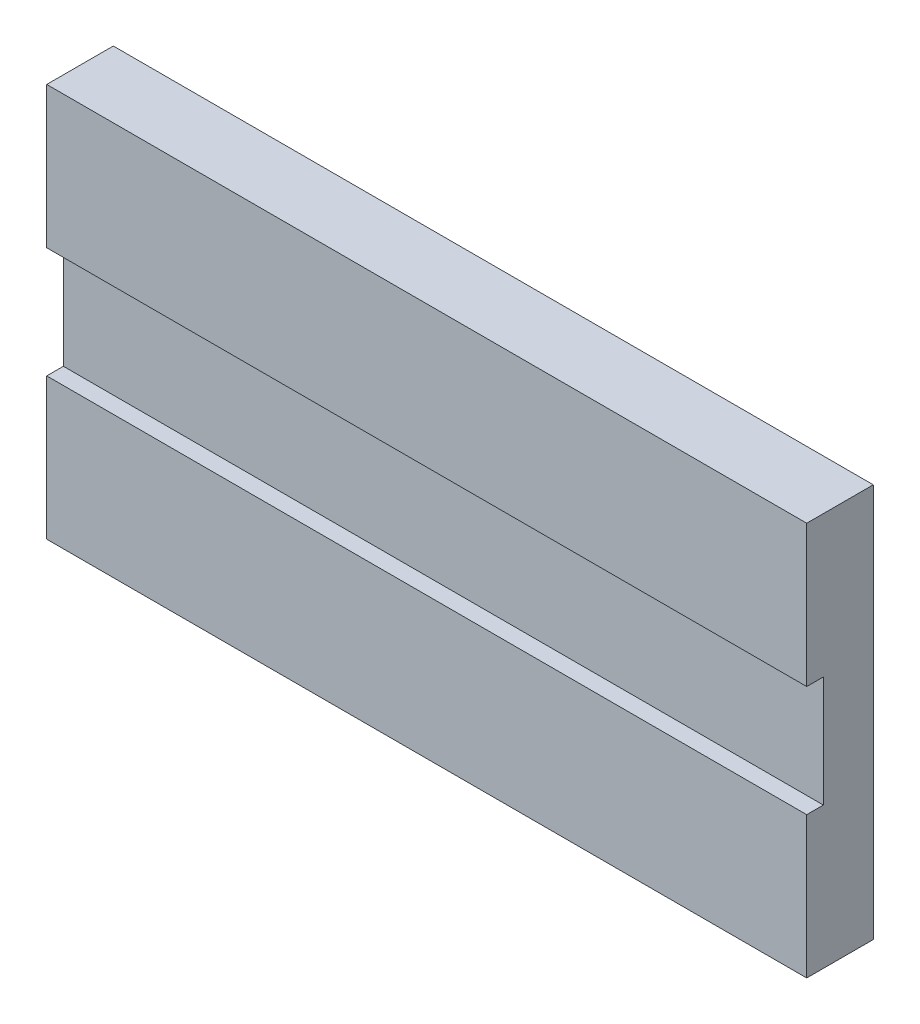
ISO-10303-21;
HEADER;
FILE_DESCRIPTION(('STEP AP214'),'2;1');
FILE_NAME('part.step','',(''),(''),'','','');
FILE_SCHEMA(('AUTOMOTIVE_DESIGN { 1 0 10303 214 1 1 1 1 }'));
ENDSEC;
DATA;
#1=APPLICATION_CONTEXT('core data for automotive mechanical design processes');
#2=APPLICATION_PROTOCOL_DEFINITION('international standard','automotive_design',2000,#1);
#3=PRODUCT_CONTEXT('',#1,'mechanical');
#4=PRODUCT('Part','Part','',(#3));
#5=PRODUCT_RELATED_PRODUCT_CATEGORY('part','',(#4));
#6=PRODUCT_DEFINITION_FORMATION('','',#4);
#7=PRODUCT_DEFINITION_CONTEXT('part definition',#1,'design');
#8=PRODUCT_DEFINITION('design','',#6,#7);
#9=PRODUCT_DEFINITION_SHAPE('','',#8);
#10=(LENGTH_UNIT() NAMED_UNIT(*) SI_UNIT(.MILLI.,.METRE.));
#11=(NAMED_UNIT(*) PLANE_ANGLE_UNIT() SI_UNIT($,.RADIAN.));
#12=(NAMED_UNIT(*) SI_UNIT($,.STERADIAN.) SOLID_ANGLE_UNIT());
#13=UNCERTAINTY_MEASURE_WITH_UNIT(LENGTH_MEASURE(1.E-05),#10,'distance_accuracy_value','');
#14=(GEOMETRIC_REPRESENTATION_CONTEXT(3) GLOBAL_UNCERTAINTY_ASSIGNED_CONTEXT((#13)) GLOBAL_UNIT_ASSIGNED_CONTEXT((#10,
#11,#12)) REPRESENTATION_CONTEXT('',''));
#15=CARTESIAN_POINT('',(0.,0.,0.));
#16=DIRECTION('',(0.,0.,1.));
#17=DIRECTION('',(1.,0.,0.));
#18=AXIS2_PLACEMENT_3D('',#15,#16,#17);
#19=CARTESIAN_POINT('',(0.,0.,12.));
#20=DIRECTION('',(0.,0.,-1.));
#21=DIRECTION('',(-1.,0.,0.));
#22=AXIS2_PLACEMENT_3D('',#19,#20,#21);
#23=PLANE('',#22);
#24=DIRECTION('',(0.,-1.,0.));
#25=VECTOR('',#24,1.);
#26=CARTESIAN_POINT('',(0.,-71.,12.));
#27=LINE('',#26,#25);
#28=CARTESIAN_POINT('',(0.,0.,12.));
#29=VERTEX_POINT('',#28);
#30=CARTESIAN_POINT('',(0.,-25.5,12.));
#31=VERTEX_POINT('',#30);
#32=EDGE_CURVE('E138',#29,#31,#27,.T.);
#33=ORIENTED_EDGE('',*,*,#32,.T.);
#34=DIRECTION('',(1.,0.,0.));
#35=VECTOR('',#34,1.);
#36=CARTESIAN_POINT('',(0.,-25.5,12.));
#37=LINE('',#36,#35);
#38=CARTESIAN_POINT('',(137.,-25.5,12.));
#39=VERTEX_POINT('',#38);
#40=EDGE_CURVE('E132',#31,#39,#37,.T.);
#41=ORIENTED_EDGE('',*,*,#40,.T.);
#42=DIRECTION('',(0.,1.,0.));
#43=VECTOR('',#42,1.);
#44=CARTESIAN_POINT('',(137.,0.,12.));
#45=LINE('',#44,#43);
#46=CARTESIAN_POINT('',(137.,0.,12.));
#47=VERTEX_POINT('',#46);
#48=EDGE_CURVE('E142',#39,#47,#45,.T.);
#49=ORIENTED_EDGE('',*,*,#48,.T.);
#50=DIRECTION('',(-1.,0.,0.));
#51=VECTOR('',#50,1.);
#52=CARTESIAN_POINT('',(0.,0.,12.));
#53=LINE('',#52,#51);
#54=EDGE_CURVE('E55',#47,#29,#53,.T.);
#55=ORIENTED_EDGE('',*,*,#54,.T.);
#56=EDGE_LOOP('',(#33,#41,#49,#55));
#57=FACE_BOUND('',#56,.T.);
#58=ADVANCED_FACE('F31',(#57),#23,.F.);
#59=CARTESIAN_POINT('',(0.,-71.,12.));
#60=DIRECTION('',(1.,0.,0.));
#61=DIRECTION('',(0.,0.,-1.));
#62=AXIS2_PLACEMENT_3D('',#59,#60,#61);
#63=PLANE('',#62);
#64=DIRECTION('',(0.,1.,0.));
#65=VECTOR('',#64,1.);
#66=CARTESIAN_POINT('',(0.,-45.5,9.));
#67=LINE('',#66,#65);
#68=CARTESIAN_POINT('',(0.,-45.5,9.));
#69=VERTEX_POINT('',#68);
#70=CARTESIAN_POINT('',(0.,-25.5,9.));
#71=VERTEX_POINT('',#70);
#72=EDGE_CURVE('E116',#69,#71,#67,.T.);
#73=ORIENTED_EDGE('',*,*,#72,.T.);
#74=DIRECTION('',(0.,0.,1.));
#75=VECTOR('',#74,1.);
#76=CARTESIAN_POINT('',(0.,-25.5,9.));
#77=LINE('',#76,#75);
#78=EDGE_CURVE('E121',#71,#31,#77,.T.);
#79=ORIENTED_EDGE('',*,*,#78,.T.);
#80=ORIENTED_EDGE('',*,*,#32,.F.);
#81=DIRECTION('',(0.,0.,-1.));
#82=VECTOR('',#81,1.);
#83=CARTESIAN_POINT('',(0.,0.,12.));
#84=LINE('',#83,#82);
#85=CARTESIAN_POINT('',(0.,0.,0.));
#86=VERTEX_POINT('',#85);
#87=EDGE_CURVE('E147',#29,#86,#84,.T.);
#88=ORIENTED_EDGE('',*,*,#87,.T.);
#89=DIRECTION('',(0.,-1.,0.));
#90=VECTOR('',#89,1.);
#91=CARTESIAN_POINT('',(0.,-71.,0.));
#92=LINE('',#91,#90);
#93=CARTESIAN_POINT('',(0.,-71.,0.));
#94=VERTEX_POINT('',#93);
#95=EDGE_CURVE('E135',#86,#94,#92,.T.);
#96=ORIENTED_EDGE('',*,*,#95,.T.);
#97=DIRECTION('',(0.,0.,-1.));
#98=VECTOR('',#97,1.);
#99=CARTESIAN_POINT('',(0.,-71.,12.));
#100=LINE('',#99,#98);
#101=CARTESIAN_POINT('',(0.,-71.,12.));
#102=VERTEX_POINT('',#101);
#103=EDGE_CURVE('E11',#102,#94,#100,.T.);
#104=ORIENTED_EDGE('',*,*,#103,.F.);
#105=CARTESIAN_POINT('',(0.,-45.5,12.));
#106=VERTEX_POINT('',#105);
#107=EDGE_CURVE('E83',#106,#102,#27,.T.);
#108=ORIENTED_EDGE('',*,*,#107,.F.);
#109=DIRECTION('',(0.,0.,-1.));
#110=VECTOR('',#109,1.);
#111=CARTESIAN_POINT('',(0.,-45.5,12.));
#112=LINE('',#111,#110);
#113=EDGE_CURVE('E46',#106,#69,#112,.T.);
#114=ORIENTED_EDGE('',*,*,#113,.T.);
#115=EDGE_LOOP('',(#73,#79,#80,#88,#96,#104,#108,#114));
#116=FACE_BOUND('',#115,.T.);
#117=ADVANCED_FACE('F33',(#116),#63,.F.);
#118=CARTESIAN_POINT('',(137.,-71.,12.));
#119=DIRECTION('',(0.,1.,0.));
#120=DIRECTION('',(-1.,0.,0.));
#121=AXIS2_PLACEMENT_3D('',#118,#119,#120);
#122=PLANE('',#121);
#123=DIRECTION('',(1.,0.,0.));
#124=VECTOR('',#123,1.);
#125=CARTESIAN_POINT('',(137.,-71.,0.));
#126=LINE('',#125,#124);
#127=CARTESIAN_POINT('',(137.,-71.,0.));
#128=VERTEX_POINT('',#127);
#129=EDGE_CURVE('E150',#94,#128,#126,.T.);
#130=ORIENTED_EDGE('',*,*,#129,.T.);
#131=DIRECTION('',(0.,0.,-1.));
#132=VECTOR('',#131,1.);
#133=CARTESIAN_POINT('',(137.,-71.,12.));
#134=LINE('',#133,#132);
#135=CARTESIAN_POINT('',(137.,-71.,12.));
#136=VERTEX_POINT('',#135);
#137=EDGE_CURVE('E39',#136,#128,#134,.T.);
#138=ORIENTED_EDGE('',*,*,#137,.F.);
#139=DIRECTION('',(1.,0.,0.));
#140=VECTOR('',#139,1.);
#141=CARTESIAN_POINT('',(137.,-71.,12.));
#142=LINE('',#141,#140);
#143=EDGE_CURVE('E140',#102,#136,#142,.T.);
#144=ORIENTED_EDGE('',*,*,#143,.F.);
#145=ORIENTED_EDGE('',*,*,#103,.T.);
#146=EDGE_LOOP('',(#130,#138,#144,#145));
#147=FACE_BOUND('',#146,.T.);
#148=ADVANCED_FACE('F175',(#147),#122,.F.);
#149=CARTESIAN_POINT('',(137.,0.,12.));
#150=DIRECTION('',(-1.,0.,0.));
#151=DIRECTION('',(0.,0.,1.));
#152=AXIS2_PLACEMENT_3D('',#149,#150,#151);
#153=PLANE('',#152);
#154=ORIENTED_EDGE('',*,*,#48,.F.);
#155=DIRECTION('',(0.,0.,1.));
#156=VECTOR('',#155,1.);
#157=CARTESIAN_POINT('',(137.,-25.5,9.));
#158=LINE('',#157,#156);
#159=CARTESIAN_POINT('',(137.,-25.5,9.));
#160=VERTEX_POINT('',#159);
#161=EDGE_CURVE('E124',#160,#39,#158,.T.);
#162=ORIENTED_EDGE('',*,*,#161,.F.);
#163=DIRECTION('',(0.,1.,0.));
#164=VECTOR('',#163,1.);
#165=CARTESIAN_POINT('',(137.,-45.5,9.));
#166=LINE('',#165,#164);
#167=CARTESIAN_POINT('',(137.,-45.5,9.));
#168=VERTEX_POINT('',#167);
#169=EDGE_CURVE('E126',#168,#160,#166,.T.);
#170=ORIENTED_EDGE('',*,*,#169,.F.);
#171=DIRECTION('',(0.,0.,-1.));
#172=VECTOR('',#171,1.);
#173=CARTESIAN_POINT('',(137.,-45.5,12.));
#174=LINE('',#173,#172);
#175=CARTESIAN_POINT('',(137.,-45.5,12.));
#176=VERTEX_POINT('',#175);
#177=EDGE_CURVE('E108',#176,#168,#174,.T.);
#178=ORIENTED_EDGE('',*,*,#177,.F.);
#179=EDGE_CURVE('E143',#136,#176,#45,.T.);
#180=ORIENTED_EDGE('',*,*,#179,.F.);
#181=ORIENTED_EDGE('',*,*,#137,.T.);
#182=DIRECTION('',(0.,1.,0.));
#183=VECTOR('',#182,1.);
#184=CARTESIAN_POINT('',(137.,0.,0.));
#185=LINE('',#184,#183);
#186=CARTESIAN_POINT('',(137.,0.,0.));
#187=VERTEX_POINT('',#186);
#188=EDGE_CURVE('E152',#128,#187,#185,.T.);
#189=ORIENTED_EDGE('',*,*,#188,.T.);
#190=DIRECTION('',(0.,0.,-1.));
#191=VECTOR('',#190,1.);
#192=CARTESIAN_POINT('',(137.,0.,12.));
#193=LINE('',#192,#191);
#194=EDGE_CURVE('E156',#47,#187,#193,.T.);
#195=ORIENTED_EDGE('',*,*,#194,.F.);
#196=EDGE_LOOP('',(#154,#162,#170,#178,#180,#181,#189,#195));
#197=FACE_BOUND('',#196,.T.);
#198=ADVANCED_FACE('F163',(#197),#153,.F.);
#199=CARTESIAN_POINT('',(0.,0.,12.));
#200=DIRECTION('',(0.,-1.,0.));
#201=DIRECTION('',(0.,0.,-1.));
#202=AXIS2_PLACEMENT_3D('',#199,#200,#201);
#203=PLANE('',#202);
#204=DIRECTION('',(-1.,0.,0.));
#205=VECTOR('',#204,1.);
#206=CARTESIAN_POINT('',(0.,0.,0.));
#207=LINE('',#206,#205);
#208=EDGE_CURVE('E76',#187,#86,#207,.T.);
#209=ORIENTED_EDGE('',*,*,#208,.T.);
#210=ORIENTED_EDGE('',*,*,#87,.F.);
#211=ORIENTED_EDGE('',*,*,#54,.F.);
#212=ORIENTED_EDGE('',*,*,#194,.T.);
#213=EDGE_LOOP('',(#209,#210,#211,#212));
#214=FACE_BOUND('',#213,.T.);
#215=ADVANCED_FACE('F170',(#214),#203,.F.);
#216=ORIENTED_EDGE('',*,*,#179,.T.);
#217=DIRECTION('',(1.,0.,0.));
#218=VECTOR('',#217,1.);
#219=CARTESIAN_POINT('',(0.,-45.5,12.));
#220=LINE('',#219,#218);
#221=EDGE_CURVE('E113',#106,#176,#220,.T.);
#222=ORIENTED_EDGE('',*,*,#221,.F.);
#223=ORIENTED_EDGE('',*,*,#107,.T.);
#224=ORIENTED_EDGE('',*,*,#143,.T.);
#225=EDGE_LOOP('',(#216,#222,#223,#224));
#226=FACE_BOUND('',#225,.T.);
#227=ADVANCED_FACE('F174',(#226),#23,.F.);
#228=CARTESIAN_POINT('',(0.,0.,0.));
#229=DIRECTION('',(0.,0.,-1.));
#230=DIRECTION('',(-1.,0.,0.));
#231=AXIS2_PLACEMENT_3D('',#228,#229,#230);
#232=PLANE('',#231);
#233=ORIENTED_EDGE('',*,*,#95,.F.);
#234=ORIENTED_EDGE('',*,*,#208,.F.);
#235=ORIENTED_EDGE('',*,*,#188,.F.);
#236=ORIENTED_EDGE('',*,*,#129,.F.);
#237=EDGE_LOOP('',(#233,#234,#235,#236));
#238=FACE_BOUND('',#237,.T.);
#239=ADVANCED_FACE('F168',(#238),#232,.T.);
#240=CARTESIAN_POINT('',(0.,-25.5,9.));
#241=DIRECTION('',(0.,1.,0.));
#242=DIRECTION('',(0.,0.,1.));
#243=AXIS2_PLACEMENT_3D('',#240,#241,#242);
#244=PLANE('',#243);
#245=ORIENTED_EDGE('',*,*,#161,.T.);
#246=ORIENTED_EDGE('',*,*,#40,.F.);
#247=ORIENTED_EDGE('',*,*,#78,.F.);
#248=DIRECTION('',(1.,0.,0.));
#249=VECTOR('',#248,1.);
#250=CARTESIAN_POINT('',(0.,-25.5,9.));
#251=LINE('',#250,#249);
#252=EDGE_CURVE('E112',#71,#160,#251,.T.);
#253=ORIENTED_EDGE('',*,*,#252,.T.);
#254=EDGE_LOOP('',(#245,#246,#247,#253));
#255=FACE_BOUND('',#254,.T.);
#256=ADVANCED_FACE('F173',(#255),#244,.F.);
#257=CARTESIAN_POINT('',(0.,-45.5,9.));
#258=DIRECTION('',(0.,0.,-1.));
#259=DIRECTION('',(-1.,0.,0.));
#260=AXIS2_PLACEMENT_3D('',#257,#258,#259);
#261=PLANE('',#260);
#262=ORIENTED_EDGE('',*,*,#169,.T.);
#263=ORIENTED_EDGE('',*,*,#252,.F.);
#264=ORIENTED_EDGE('',*,*,#72,.F.);
#265=DIRECTION('',(1.,0.,0.));
#266=VECTOR('',#265,1.);
#267=CARTESIAN_POINT('',(0.,-45.5,9.));
#268=LINE('',#267,#266);
#269=EDGE_CURVE('E104',#69,#168,#268,.T.);
#270=ORIENTED_EDGE('',*,*,#269,.T.);
#271=EDGE_LOOP('',(#262,#263,#264,#270));
#272=FACE_BOUND('',#271,.T.);
#273=ADVANCED_FACE('F117',(#272),#261,.F.);
#274=CARTESIAN_POINT('',(0.,-45.5,12.));
#275=DIRECTION('',(0.,-1.,0.));
#276=DIRECTION('',(0.,0.,-1.));
#277=AXIS2_PLACEMENT_3D('',#274,#275,#276);
#278=PLANE('',#277);
#279=ORIENTED_EDGE('',*,*,#177,.T.);
#280=ORIENTED_EDGE('',*,*,#269,.F.);
#281=ORIENTED_EDGE('',*,*,#113,.F.);
#282=ORIENTED_EDGE('',*,*,#221,.T.);
#283=EDGE_LOOP('',(#279,#280,#281,#282));
#284=FACE_BOUND('',#283,.T.);
#285=ADVANCED_FACE('F106',(#284),#278,.F.);
#286=CLOSED_SHELL('',(#58,#117,#148,#198,#215,#227,#239,#256,#273,#285));
#287=MANIFOLD_SOLID_BREP('B2',#286);
#288=ADVANCED_BREP_SHAPE_REPRESENTATION('',(#18,#287),#14);
#289=SHAPE_DEFINITION_REPRESENTATION(#9,#288);
ENDSEC;
END-ISO-10303-21;
